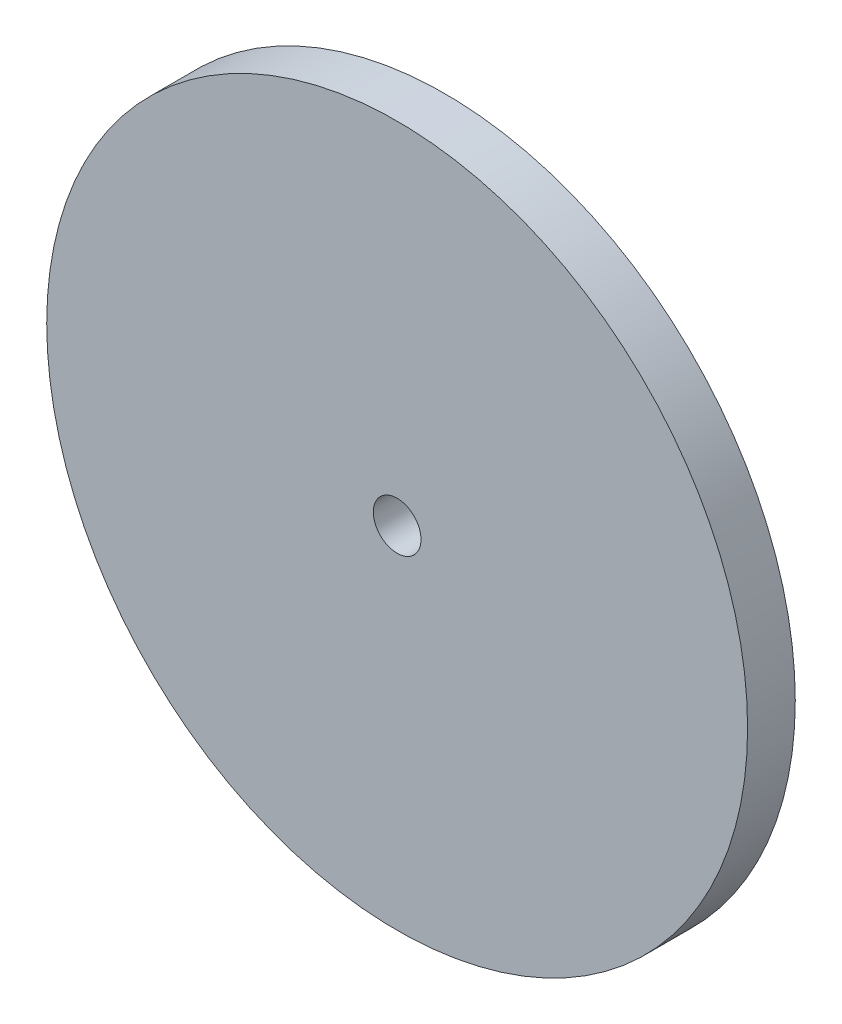
ISO-10303-21;
HEADER;
FILE_DESCRIPTION(('STEP AP214'),'2;1');
FILE_NAME('part.step','',(''),(''),'','','');
FILE_SCHEMA(('AUTOMOTIVE_DESIGN { 1 0 10303 214 1 1 1 1 }'));
ENDSEC;
DATA;
#1=APPLICATION_CONTEXT('core data for automotive mechanical design processes');
#2=APPLICATION_PROTOCOL_DEFINITION('international standard','automotive_design',2000,#1);
#3=PRODUCT_CONTEXT('',#1,'mechanical');
#4=PRODUCT('Part','Part','',(#3));
#5=PRODUCT_RELATED_PRODUCT_CATEGORY('part','',(#4));
#6=PRODUCT_DEFINITION_FORMATION('','',#4);
#7=PRODUCT_DEFINITION_CONTEXT('part definition',#1,'design');
#8=PRODUCT_DEFINITION('design','',#6,#7);
#9=PRODUCT_DEFINITION_SHAPE('','',#8);
#10=(LENGTH_UNIT() NAMED_UNIT(*) SI_UNIT(.MILLI.,.METRE.));
#11=(NAMED_UNIT(*) PLANE_ANGLE_UNIT() SI_UNIT($,.RADIAN.));
#12=(NAMED_UNIT(*) SI_UNIT($,.STERADIAN.) SOLID_ANGLE_UNIT());
#13=UNCERTAINTY_MEASURE_WITH_UNIT(LENGTH_MEASURE(1.E-05),#10,'distance_accuracy_value','');
#14=(GEOMETRIC_REPRESENTATION_CONTEXT(3) GLOBAL_UNCERTAINTY_ASSIGNED_CONTEXT((#13)) GLOBAL_UNIT_ASSIGNED_CONTEXT((#10,
#11,#12)) REPRESENTATION_CONTEXT('',''));
#15=CARTESIAN_POINT('',(0.,0.,0.));
#16=DIRECTION('',(0.,0.,1.));
#17=DIRECTION('',(1.,0.,0.));
#18=AXIS2_PLACEMENT_3D('',#15,#16,#17);
#19=CARTESIAN_POINT('',(0.,0.,1.));
#20=DIRECTION('',(0.,0.,1.));
#21=DIRECTION('',(1.,0.,0.));
#22=AXIS2_PLACEMENT_3D('',#19,#20,#21);
#23=PLANE('',#22);
#24=CARTESIAN_POINT('',(0.,0.,1.));
#25=DIRECTION('',(0.,0.,1.));
#26=DIRECTION('',(1.,0.,0.));
#27=AXIS2_PLACEMENT_3D('',#24,#25,#26);
#28=CIRCLE('',#27,7.35);
#29=CARTESIAN_POINT('',(7.35,0.,1.));
#30=VERTEX_POINT('',#29);
#31=EDGE_CURVE('E10',#30,#30,#28,.T.);
#32=ORIENTED_EDGE('',*,*,#31,.T.);
#33=EDGE_LOOP('',(#32));
#34=FACE_BOUND('',#33,.T.);
#35=CARTESIAN_POINT('',(0.,0.,1.));
#36=DIRECTION('',(0.,0.,1.));
#37=DIRECTION('',(1.,0.,0.));
#38=AXIS2_PLACEMENT_3D('',#35,#36,#37);
#39=CIRCLE('',#38,0.5);
#40=CARTESIAN_POINT('',(0.5,0.,1.));
#41=VERTEX_POINT('',#40);
#42=EDGE_CURVE('E41',#41,#41,#39,.T.);
#43=ORIENTED_EDGE('',*,*,#42,.F.);
#44=EDGE_LOOP('',(#43));
#45=FACE_BOUND('',#44,.T.);
#46=ADVANCED_FACE('F30',(#34,#45),#23,.T.);
#47=CARTESIAN_POINT('',(0.,0.,0.));
#48=DIRECTION('',(0.,0.,1.));
#49=DIRECTION('',(1.,0.,0.));
#50=AXIS2_PLACEMENT_3D('',#47,#48,#49);
#51=PLANE('',#50);
#52=CARTESIAN_POINT('',(0.,0.,0.));
#53=DIRECTION('',(0.,0.,1.));
#54=DIRECTION('',(1.,0.,0.));
#55=AXIS2_PLACEMENT_3D('',#52,#53,#54);
#56=CIRCLE('',#55,7.35);
#57=CARTESIAN_POINT('',(7.35,0.,0.));
#58=VERTEX_POINT('',#57);
#59=EDGE_CURVE('E34',#58,#58,#56,.T.);
#60=ORIENTED_EDGE('',*,*,#59,.F.);
#61=EDGE_LOOP('',(#60));
#62=FACE_BOUND('',#61,.T.);
#63=CARTESIAN_POINT('',(0.,0.,0.));
#64=DIRECTION('',(0.,0.,1.));
#65=DIRECTION('',(1.,0.,0.));
#66=AXIS2_PLACEMENT_3D('',#63,#64,#65);
#67=CIRCLE('',#66,0.5);
#68=CARTESIAN_POINT('',(0.5,0.,0.));
#69=VERTEX_POINT('',#68);
#70=EDGE_CURVE('E43',#69,#69,#67,.T.);
#71=ORIENTED_EDGE('',*,*,#70,.T.);
#72=EDGE_LOOP('',(#71));
#73=FACE_BOUND('',#72,.T.);
#74=ADVANCED_FACE('F53',(#62,#73),#51,.F.);
#75=CARTESIAN_POINT('',(0.,0.,1.));
#76=DIRECTION('',(0.,0.,-1.));
#77=DIRECTION('',(-1.,0.,0.));
#78=AXIS2_PLACEMENT_3D('',#75,#76,#77);
#79=CYLINDRICAL_SURFACE('',#78,7.35);
#80=ORIENTED_EDGE('',*,*,#31,.F.);
#81=EDGE_LOOP('',(#80));
#82=FACE_BOUND('',#81,.T.);
#83=ORIENTED_EDGE('',*,*,#59,.T.);
#84=EDGE_LOOP('',(#83));
#85=FACE_BOUND('',#84,.T.);
#86=ADVANCED_FACE('F32',(#82,#85),#79,.T.);
#87=CARTESIAN_POINT('',(0.,0.,1.));
#88=DIRECTION('',(0.,0.,-1.));
#89=DIRECTION('',(-1.,0.,0.));
#90=AXIS2_PLACEMENT_3D('',#87,#88,#89);
#91=CYLINDRICAL_SURFACE('',#90,0.5);
#92=ORIENTED_EDGE('',*,*,#42,.T.);
#93=EDGE_LOOP('',(#92));
#94=FACE_BOUND('',#93,.T.);
#95=ORIENTED_EDGE('',*,*,#70,.F.);
#96=EDGE_LOOP('',(#95));
#97=FACE_BOUND('',#96,.T.);
#98=ADVANCED_FACE('F49',(#94,#97),#91,.F.);
#99=CLOSED_SHELL('',(#46,#74,#86,#98));
#100=MANIFOLD_SOLID_BREP('B2',#99);
#101=ADVANCED_BREP_SHAPE_REPRESENTATION('',(#18,#100),#14);
#102=SHAPE_DEFINITION_REPRESENTATION(#9,#101);
ENDSEC;
END-ISO-10303-21;
